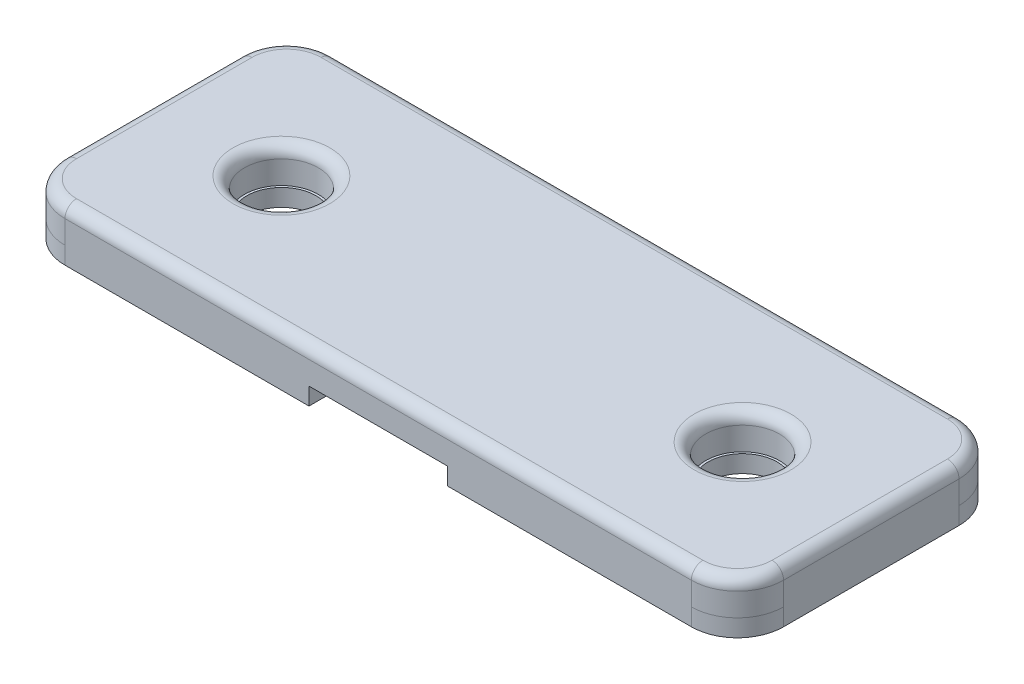
ISO-10303-21;
HEADER;
FILE_DESCRIPTION(('STEP AP214'),'2;1');
FILE_NAME('part.step','',(''),(''),'','','');
FILE_SCHEMA(('AUTOMOTIVE_DESIGN { 1 0 10303 214 1 1 1 1 }'));
ENDSEC;
DATA;
#1=APPLICATION_CONTEXT('core data for automotive mechanical design processes');
#2=APPLICATION_PROTOCOL_DEFINITION('international standard','automotive_design',2000,#1);
#3=PRODUCT_CONTEXT('',#1,'mechanical');
#4=PRODUCT('Part','Part','',(#3));
#5=PRODUCT_RELATED_PRODUCT_CATEGORY('part','',(#4));
#6=PRODUCT_DEFINITION_FORMATION('','',#4);
#7=PRODUCT_DEFINITION_CONTEXT('part definition',#1,'design');
#8=PRODUCT_DEFINITION('design','',#6,#7);
#9=PRODUCT_DEFINITION_SHAPE('','',#8);
#10=(LENGTH_UNIT() NAMED_UNIT(*) SI_UNIT(.MILLI.,.METRE.));
#11=(NAMED_UNIT(*) PLANE_ANGLE_UNIT() SI_UNIT($,.RADIAN.));
#12=(NAMED_UNIT(*) SI_UNIT($,.STERADIAN.) SOLID_ANGLE_UNIT());
#13=UNCERTAINTY_MEASURE_WITH_UNIT(LENGTH_MEASURE(1.E-05),#10,'distance_accuracy_value','');
#14=(GEOMETRIC_REPRESENTATION_CONTEXT(3) GLOBAL_UNCERTAINTY_ASSIGNED_CONTEXT((#13)) GLOBAL_UNIT_ASSIGNED_CONTEXT((#10,
#11,#12)) REPRESENTATION_CONTEXT('',''));
#15=CARTESIAN_POINT('',(0.,0.,0.));
#16=DIRECTION('',(0.,0.,1.));
#17=DIRECTION('',(1.,0.,0.));
#18=AXIS2_PLACEMENT_3D('',#15,#16,#17);
#19=CARTESIAN_POINT('',(0.,0.,0.));
#20=DIRECTION('',(0.,1.,0.));
#21=DIRECTION('',(0.,0.,1.));
#22=AXIS2_PLACEMENT_3D('',#19,#20,#21);
#23=PLANE('',#22);
#24=DIRECTION('',(0.,0.,-1.));
#25=VECTOR('',#24,1.);
#26=CARTESIAN_POINT('',(3.,0.,5.80440630927871));
#27=LINE('',#26,#25);
#28=CARTESIAN_POINT('',(3.,0.,5.80440630927871));
#29=VERTEX_POINT('',#28);
#30=CARTESIAN_POINT('',(3.,0.,-5.80440630927871));
#31=VERTEX_POINT('',#30);
#32=EDGE_CURVE('E196',#29,#31,#27,.T.);
#33=ORIENTED_EDGE('',*,*,#32,.F.);
#34=DIRECTION('',(1.,0.,0.));
#35=VECTOR('',#34,1.);
#36=CARTESIAN_POINT('',(15.5833614940028,0.,5.80440630927871));
#37=LINE('',#36,#35);
#38=CARTESIAN_POINT('',(-3.,0.,5.80440630927871));
#39=VERTEX_POINT('',#38);
#40=EDGE_CURVE('E236',#39,#29,#37,.T.);
#41=ORIENTED_EDGE('',*,*,#40,.F.);
#42=DIRECTION('',(0.,0.,1.));
#43=VECTOR('',#42,1.);
#44=CARTESIAN_POINT('',(-3.,0.,5.80440630927871));
#45=LINE('',#44,#43);
#46=CARTESIAN_POINT('',(-3.,0.,-5.80440630927871));
#47=VERTEX_POINT('',#46);
#48=EDGE_CURVE('E209',#47,#39,#45,.T.);
#49=ORIENTED_EDGE('',*,*,#48,.F.);
#50=DIRECTION('',(-1.,0.,0.));
#51=VECTOR('',#50,1.);
#52=CARTESIAN_POINT('',(15.5833614940028,0.,-5.80440630927871));
#53=LINE('',#52,#51);
#54=EDGE_CURVE('E239',#31,#47,#53,.T.);
#55=ORIENTED_EDGE('',*,*,#54,.F.);
#56=EDGE_LOOP('',(#33,#41,#49,#55));
#57=FACE_BOUND('',#56,.T.);
#58=ADVANCED_FACE('F33',(#57),#23,.F.);
#59=CARTESIAN_POINT('',(0.,1.5,0.));
#60=DIRECTION('',(0.,1.,0.));
#61=DIRECTION('',(0.,0.,1.));
#62=AXIS2_PLACEMENT_3D('',#59,#60,#61);
#63=PLANE('',#62);
#64=CARTESIAN_POINT('',(10.,1.5,0.));
#65=DIRECTION('',(0.,1.,0.));
#66=DIRECTION('',(0.,0.,1.));
#67=AXIS2_PLACEMENT_3D('',#64,#65,#66);
#68=CIRCLE('',#67,2.1);
#69=CARTESIAN_POINT('',(10.,1.5,2.1));
#70=VERTEX_POINT('',#69);
#71=EDGE_CURVE('E317',#70,#70,#68,.F.);
#72=ORIENTED_EDGE('',*,*,#71,.T.);
#73=EDGE_LOOP('',(#72));
#74=FACE_BOUND('',#73,.T.);
#75=DIRECTION('',(0.,0.,-1.));
#76=VECTOR('',#75,1.);
#77=CARTESIAN_POINT('',(15.0833614940028,1.5,-3.80440630927871));
#78=LINE('',#77,#76);
#79=CARTESIAN_POINT('',(15.0833614940028,1.5,3.80440630927871));
#80=VERTEX_POINT('',#79);
#81=CARTESIAN_POINT('',(15.0833614940028,1.5,-3.80440630927871));
#82=VERTEX_POINT('',#81);
#83=EDGE_CURVE('E312',#80,#82,#78,.T.);
#84=ORIENTED_EDGE('',*,*,#83,.T.);
#85=CARTESIAN_POINT('',(13.5833614940028,1.5,-3.80440630927871));
#86=DIRECTION('',(0.,1.,0.));
#87=DIRECTION('',(0.,0.,1.));
#88=AXIS2_PLACEMENT_3D('',#85,#86,#87);
#89=CIRCLE('',#88,1.5);
#90=CARTESIAN_POINT('',(13.5833614940028,1.5,-5.30440630927871));
#91=VERTEX_POINT('',#90);
#92=EDGE_CURVE('E314',#82,#91,#89,.T.);
#93=ORIENTED_EDGE('',*,*,#92,.T.);
#94=DIRECTION('',(-1.,0.,0.));
#95=VECTOR('',#94,1.);
#96=CARTESIAN_POINT('',(-13.5833614940028,1.5,-5.30440630927871));
#97=LINE('',#96,#95);
#98=CARTESIAN_POINT('',(-13.5833614940028,1.5,-5.30440630927871));
#99=VERTEX_POINT('',#98);
#100=EDGE_CURVE('E300',#91,#99,#97,.T.);
#101=ORIENTED_EDGE('',*,*,#100,.T.);
#102=CARTESIAN_POINT('',(-13.5833614940028,1.5,-3.80440630927871));
#103=DIRECTION('',(0.,1.,0.));
#104=DIRECTION('',(0.,0.,1.));
#105=AXIS2_PLACEMENT_3D('',#102,#103,#104);
#106=CIRCLE('',#105,1.5);
#107=CARTESIAN_POINT('',(-15.0833614940028,1.5,-3.80440630927871));
#108=VERTEX_POINT('',#107);
#109=EDGE_CURVE('E302',#99,#108,#106,.T.);
#110=ORIENTED_EDGE('',*,*,#109,.T.);
#111=DIRECTION('',(0.,0.,1.));
#112=VECTOR('',#111,1.);
#113=CARTESIAN_POINT('',(-15.0833614940028,1.5,3.80440630927871));
#114=LINE('',#113,#112);
#115=CARTESIAN_POINT('',(-15.0833614940028,1.5,3.80440630927871));
#116=VERTEX_POINT('',#115);
#117=EDGE_CURVE('E304',#108,#116,#114,.T.);
#118=ORIENTED_EDGE('',*,*,#117,.T.);
#119=CARTESIAN_POINT('',(-13.5833614940028,1.5,3.80440630927871));
#120=DIRECTION('',(0.,1.,0.));
#121=DIRECTION('',(0.,0.,1.));
#122=AXIS2_PLACEMENT_3D('',#119,#120,#121);
#123=CIRCLE('',#122,1.5);
#124=CARTESIAN_POINT('',(-13.5833614940028,1.5,5.30440630927871));
#125=VERTEX_POINT('',#124);
#126=EDGE_CURVE('E306',#116,#125,#123,.T.);
#127=ORIENTED_EDGE('',*,*,#126,.T.);
#128=DIRECTION('',(1.,0.,0.));
#129=VECTOR('',#128,1.);
#130=CARTESIAN_POINT('',(13.5833614940028,1.5,5.30440630927871));
#131=LINE('',#130,#129);
#132=CARTESIAN_POINT('',(13.5833614940028,1.5,5.30440630927871));
#133=VERTEX_POINT('',#132);
#134=EDGE_CURVE('E308',#125,#133,#131,.T.);
#135=ORIENTED_EDGE('',*,*,#134,.T.);
#136=CARTESIAN_POINT('',(13.5833614940028,1.5,3.80440630927871));
#137=DIRECTION('',(0.,1.,0.));
#138=DIRECTION('',(0.,0.,1.));
#139=AXIS2_PLACEMENT_3D('',#136,#137,#138);
#140=CIRCLE('',#139,1.5);
#141=EDGE_CURVE('E310',#133,#80,#140,.T.);
#142=ORIENTED_EDGE('',*,*,#141,.T.);
#143=EDGE_LOOP('',(#84,#93,#101,#110,#118,#127,#135,#142));
#144=FACE_BOUND('',#143,.T.);
#145=CARTESIAN_POINT('',(-10.,1.5,0.));
#146=DIRECTION('',(0.,1.,0.));
#147=DIRECTION('',(0.,0.,1.));
#148=AXIS2_PLACEMENT_3D('',#145,#146,#147);
#149=CIRCLE('',#148,2.1);
#150=CARTESIAN_POINT('',(-10.,1.5,2.1));
#151=VERTEX_POINT('',#150);
#152=EDGE_CURVE('E297',#151,#151,#149,.F.);
#153=ORIENTED_EDGE('',*,*,#152,.T.);
#154=EDGE_LOOP('',(#153));
#155=FACE_BOUND('',#154,.T.);
#156=ADVANCED_FACE('F397',(#74,#144,#155),#63,.T.);
#157=CARTESIAN_POINT('',(-15.5833614940028,1.5,5.80440630927871));
#158=DIRECTION('',(1.,0.,0.));
#159=DIRECTION('',(0.,0.,-1.));
#160=AXIS2_PLACEMENT_3D('',#157,#158,#159);
#161=PLANE('',#160);
#162=DIRECTION('',(0.,-1.,0.));
#163=VECTOR('',#162,1.);
#164=CARTESIAN_POINT('',(-15.5833614940028,1.5,3.80440630927871));
#165=LINE('',#164,#163);
#166=CARTESIAN_POINT('',(-15.5833614940028,0.,3.80440630927871));
#167=VERTEX_POINT('',#166);
#168=CARTESIAN_POINT('',(-15.5833614940028,1.,3.80440630927871));
#169=VERTEX_POINT('',#168);
#170=EDGE_CURVE('E241',#167,#169,#165,.F.);
#171=ORIENTED_EDGE('',*,*,#170,.T.);
#172=DIRECTION('',(0.,0.,1.));
#173=VECTOR('',#172,1.);
#174=CARTESIAN_POINT('',(-15.5833614940028,1.,-3.80440630927871));
#175=LINE('',#174,#173);
#176=CARTESIAN_POINT('',(-15.5833614940028,1.,-3.80440630927871));
#177=VERTEX_POINT('',#176);
#178=EDGE_CURVE('E58',#169,#177,#175,.F.);
#179=ORIENTED_EDGE('',*,*,#178,.T.);
#180=DIRECTION('',(0.,-1.,0.));
#181=VECTOR('',#180,1.);
#182=CARTESIAN_POINT('',(-15.5833614940028,1.5,-3.80440630927871));
#183=LINE('',#182,#181);
#184=CARTESIAN_POINT('',(-15.5833614940028,0.,-3.80440630927871));
#185=VERTEX_POINT('',#184);
#186=EDGE_CURVE('E243',#177,#185,#183,.T.);
#187=ORIENTED_EDGE('',*,*,#186,.T.);
#188=DIRECTION('',(0.,1.,0.));
#189=VECTOR('',#188,1.);
#190=CARTESIAN_POINT('',(-15.5833614940028,1.5,-3.80440630927871));
#191=LINE('',#190,#189);
#192=CARTESIAN_POINT('',(-15.5833614940028,-0.75,-3.80440630927871));
#193=VERTEX_POINT('',#192);
#194=EDGE_CURVE('E267',#185,#193,#191,.F.);
#195=ORIENTED_EDGE('',*,*,#194,.T.);
#196=DIRECTION('',(0.,0.,-1.));
#197=VECTOR('',#196,1.);
#198=CARTESIAN_POINT('',(-15.5833614940028,-0.75,5.80440630927871));
#199=LINE('',#198,#197);
#200=CARTESIAN_POINT('',(-15.5833614940028,-0.75,3.80440630927871));
#201=VERTEX_POINT('',#200);
#202=EDGE_CURVE('E217',#201,#193,#199,.T.);
#203=ORIENTED_EDGE('',*,*,#202,.F.);
#204=DIRECTION('',(0.,1.,0.));
#205=VECTOR('',#204,1.);
#206=CARTESIAN_POINT('',(-15.5833614940028,1.5,3.80440630927871));
#207=LINE('',#206,#205);
#208=EDGE_CURVE('E269',#201,#167,#207,.T.);
#209=ORIENTED_EDGE('',*,*,#208,.T.);
#210=EDGE_LOOP('',(#171,#179,#187,#195,#203,#209));
#211=FACE_BOUND('',#210,.T.);
#212=ADVANCED_FACE('F444',(#211),#161,.F.);
#213=CARTESIAN_POINT('',(15.5833614940028,1.5,5.80440630927871));
#214=DIRECTION('',(0.,0.,-1.));
#215=DIRECTION('',(-1.,0.,0.));
#216=AXIS2_PLACEMENT_3D('',#213,#214,#215);
#217=PLANE('',#216);
#218=DIRECTION('',(0.,-1.,0.));
#219=VECTOR('',#218,1.);
#220=CARTESIAN_POINT('',(13.5833614940028,1.5,5.80440630927871));
#221=LINE('',#220,#219);
#222=CARTESIAN_POINT('',(13.5833614940028,0.,5.80440630927871));
#223=VERTEX_POINT('',#222);
#224=CARTESIAN_POINT('',(13.5833614940028,1.,5.80440630927871));
#225=VERTEX_POINT('',#224);
#226=EDGE_CURVE('E264',#223,#225,#221,.F.);
#227=ORIENTED_EDGE('',*,*,#226,.T.);
#228=DIRECTION('',(1.,0.,0.));
#229=VECTOR('',#228,1.);
#230=CARTESIAN_POINT('',(-13.5833614940028,1.,5.80440630927871));
#231=LINE('',#230,#229);
#232=CARTESIAN_POINT('',(-13.5833614940028,1.,5.80440630927871));
#233=VERTEX_POINT('',#232);
#234=EDGE_CURVE('E327',#225,#233,#231,.F.);
#235=ORIENTED_EDGE('',*,*,#234,.T.);
#236=DIRECTION('',(0.,-1.,0.));
#237=VECTOR('',#236,1.);
#238=CARTESIAN_POINT('',(-13.5833614940028,1.5,5.80440630927871));
#239=LINE('',#238,#237);
#240=CARTESIAN_POINT('',(-13.5833614940028,0.,5.80440630927871));
#241=VERTEX_POINT('',#240);
#242=EDGE_CURVE('E262',#233,#241,#239,.T.);
#243=ORIENTED_EDGE('',*,*,#242,.T.);
#244=DIRECTION('',(0.,1.,0.));
#245=VECTOR('',#244,1.);
#246=CARTESIAN_POINT('',(-13.5833614940028,1.5,5.80440630927871));
#247=LINE('',#246,#245);
#248=CARTESIAN_POINT('',(-13.5833614940028,-0.75,5.80440630927871));
#249=VERTEX_POINT('',#248);
#250=EDGE_CURVE('E275',#241,#249,#247,.F.);
#251=ORIENTED_EDGE('',*,*,#250,.T.);
#252=DIRECTION('',(-1.,0.,0.));
#253=VECTOR('',#252,1.);
#254=CARTESIAN_POINT('',(-3.,-0.75,5.80440630927871));
#255=LINE('',#254,#253);
#256=CARTESIAN_POINT('',(-3.,-0.75,5.80440630927871));
#257=VERTEX_POINT('',#256);
#258=EDGE_CURVE('E214',#257,#249,#255,.T.);
#259=ORIENTED_EDGE('',*,*,#258,.F.);
#260=DIRECTION('',(0.,1.,0.));
#261=VECTOR('',#260,1.);
#262=CARTESIAN_POINT('',(-3.,-0.75,5.80440630927871));
#263=LINE('',#262,#261);
#264=EDGE_CURVE('E227',#257,#39,#263,.T.);
#265=ORIENTED_EDGE('',*,*,#264,.T.);
#266=ORIENTED_EDGE('',*,*,#40,.T.);
#267=DIRECTION('',(0.,1.,0.));
#268=VECTOR('',#267,1.);
#269=CARTESIAN_POINT('',(3.,-0.75,5.80440630927871));
#270=LINE('',#269,#268);
#271=CARTESIAN_POINT('',(3.,-0.75,5.80440630927871));
#272=VERTEX_POINT('',#271);
#273=EDGE_CURVE('E200',#272,#29,#270,.T.);
#274=ORIENTED_EDGE('',*,*,#273,.F.);
#275=DIRECTION('',(-1.,0.,0.));
#276=VECTOR('',#275,1.);
#277=CARTESIAN_POINT('',(3.,-0.75,5.80440630927871));
#278=LINE('',#277,#276);
#279=CARTESIAN_POINT('',(13.5833614940028,-0.75,5.80440630927871));
#280=VERTEX_POINT('',#279);
#281=EDGE_CURVE('E192',#280,#272,#278,.T.);
#282=ORIENTED_EDGE('',*,*,#281,.F.);
#283=DIRECTION('',(0.,1.,0.));
#284=VECTOR('',#283,1.);
#285=CARTESIAN_POINT('',(13.5833614940028,1.5,5.80440630927871));
#286=LINE('',#285,#284);
#287=EDGE_CURVE('E272',#280,#223,#286,.T.);
#288=ORIENTED_EDGE('',*,*,#287,.T.);
#289=EDGE_LOOP('',(#227,#235,#243,#251,#259,#265,#266,#274,#282,#288));
#290=FACE_BOUND('',#289,.T.);
#291=ADVANCED_FACE('F380',(#290),#217,.F.);
#292=CARTESIAN_POINT('',(15.5833614940028,1.5,5.80440630927871));
#293=DIRECTION('',(-1.,0.,0.));
#294=DIRECTION('',(0.,0.,1.));
#295=AXIS2_PLACEMENT_3D('',#292,#293,#294);
#296=PLANE('',#295);
#297=DIRECTION('',(0.,-1.,0.));
#298=VECTOR('',#297,1.);
#299=CARTESIAN_POINT('',(15.5833614940028,1.5,-3.80440630927871));
#300=LINE('',#299,#298);
#301=CARTESIAN_POINT('',(15.5833614940028,0.,-3.80440630927871));
#302=VERTEX_POINT('',#301);
#303=CARTESIAN_POINT('',(15.5833614940028,1.,-3.80440630927871));
#304=VERTEX_POINT('',#303);
#305=EDGE_CURVE('E259',#302,#304,#300,.F.);
#306=ORIENTED_EDGE('',*,*,#305,.T.);
#307=DIRECTION('',(0.,0.,-1.));
#308=VECTOR('',#307,1.);
#309=CARTESIAN_POINT('',(15.5833614940028,1.,3.80440630927871));
#310=LINE('',#309,#308);
#311=CARTESIAN_POINT('',(15.5833614940028,1.,3.80440630927871));
#312=VERTEX_POINT('',#311);
#313=EDGE_CURVE('E323',#304,#312,#310,.F.);
#314=ORIENTED_EDGE('',*,*,#313,.T.);
#315=DIRECTION('',(0.,-1.,0.));
#316=VECTOR('',#315,1.);
#317=CARTESIAN_POINT('',(15.5833614940028,1.5,3.80440630927871));
#318=LINE('',#317,#316);
#319=CARTESIAN_POINT('',(15.5833614940028,0.,3.80440630927871));
#320=VERTEX_POINT('',#319);
#321=EDGE_CURVE('E257',#312,#320,#318,.T.);
#322=ORIENTED_EDGE('',*,*,#321,.T.);
#323=DIRECTION('',(0.,1.,0.));
#324=VECTOR('',#323,1.);
#325=CARTESIAN_POINT('',(15.5833614940028,1.5,3.80440630927871));
#326=LINE('',#325,#324);
#327=CARTESIAN_POINT('',(15.5833614940028,-0.75,3.80440630927871));
#328=VERTEX_POINT('',#327);
#329=EDGE_CURVE('E288',#320,#328,#326,.F.);
#330=ORIENTED_EDGE('',*,*,#329,.T.);
#331=DIRECTION('',(0.,0.,1.));
#332=VECTOR('',#331,1.);
#333=CARTESIAN_POINT('',(15.5833614940028,-0.75,5.80440630927871));
#334=LINE('',#333,#332);
#335=CARTESIAN_POINT('',(15.5833614940028,-0.75,-3.80440630927871));
#336=VERTEX_POINT('',#335);
#337=EDGE_CURVE('E184',#336,#328,#334,.T.);
#338=ORIENTED_EDGE('',*,*,#337,.F.);
#339=DIRECTION('',(0.,1.,0.));
#340=VECTOR('',#339,1.);
#341=CARTESIAN_POINT('',(15.5833614940028,1.5,-3.80440630927871));
#342=LINE('',#341,#340);
#343=EDGE_CURVE('E285',#336,#302,#342,.T.);
#344=ORIENTED_EDGE('',*,*,#343,.T.);
#345=EDGE_LOOP('',(#306,#314,#322,#330,#338,#344));
#346=FACE_BOUND('',#345,.T.);
#347=ADVANCED_FACE('F452',(#346),#296,.F.);
#348=CARTESIAN_POINT('',(15.5833614940028,1.5,-5.80440630927871));
#349=DIRECTION('',(0.,0.,1.));
#350=DIRECTION('',(1.,0.,0.));
#351=AXIS2_PLACEMENT_3D('',#348,#349,#350);
#352=PLANE('',#351);
#353=DIRECTION('',(0.,-1.,0.));
#354=VECTOR('',#353,1.);
#355=CARTESIAN_POINT('',(-13.5833614940028,1.5,-5.80440630927871));
#356=LINE('',#355,#354);
#357=CARTESIAN_POINT('',(-13.5833614940028,0.,-5.80440630927871));
#358=VERTEX_POINT('',#357);
#359=CARTESIAN_POINT('',(-13.5833614940028,1.,-5.80440630927871));
#360=VERTEX_POINT('',#359);
#361=EDGE_CURVE('E255',#358,#360,#356,.F.);
#362=ORIENTED_EDGE('',*,*,#361,.T.);
#363=DIRECTION('',(-1.,0.,0.));
#364=VECTOR('',#363,1.);
#365=CARTESIAN_POINT('',(13.5833614940028,1.,-5.80440630927871));
#366=LINE('',#365,#364);
#367=CARTESIAN_POINT('',(13.5833614940028,1.,-5.80440630927871));
#368=VERTEX_POINT('',#367);
#369=EDGE_CURVE('E42',#360,#368,#366,.F.);
#370=ORIENTED_EDGE('',*,*,#369,.T.);
#371=DIRECTION('',(0.,-1.,0.));
#372=VECTOR('',#371,1.);
#373=CARTESIAN_POINT('',(13.5833614940028,1.5,-5.80440630927871));
#374=LINE('',#373,#372);
#375=CARTESIAN_POINT('',(13.5833614940028,0.,-5.80440630927871));
#376=VERTEX_POINT('',#375);
#377=EDGE_CURVE('E253',#368,#376,#374,.T.);
#378=ORIENTED_EDGE('',*,*,#377,.T.);
#379=DIRECTION('',(0.,1.,0.));
#380=VECTOR('',#379,1.);
#381=CARTESIAN_POINT('',(13.5833614940028,1.5,-5.80440630927871));
#382=LINE('',#381,#380);
#383=CARTESIAN_POINT('',(13.5833614940028,-0.75,-5.80440630927871));
#384=VERTEX_POINT('',#383);
#385=EDGE_CURVE('E181',#376,#384,#382,.F.);
#386=ORIENTED_EDGE('',*,*,#385,.T.);
#387=DIRECTION('',(1.,0.,0.));
#388=VECTOR('',#387,1.);
#389=CARTESIAN_POINT('',(3.,-0.75,-5.80440630927871));
#390=LINE('',#389,#388);
#391=CARTESIAN_POINT('',(3.,-0.75,-5.80440630927871));
#392=VERTEX_POINT('',#391);
#393=EDGE_CURVE('E174',#392,#384,#390,.T.);
#394=ORIENTED_EDGE('',*,*,#393,.F.);
#395=DIRECTION('',(0.,1.,0.));
#396=VECTOR('',#395,1.);
#397=CARTESIAN_POINT('',(3.,-0.75,-5.80440630927871));
#398=LINE('',#397,#396);
#399=EDGE_CURVE('E178',#392,#31,#398,.T.);
#400=ORIENTED_EDGE('',*,*,#399,.T.);
#401=ORIENTED_EDGE('',*,*,#54,.T.);
#402=DIRECTION('',(0.,1.,0.));
#403=VECTOR('',#402,1.);
#404=CARTESIAN_POINT('',(-3.,-0.75,-5.80440630927871));
#405=LINE('',#404,#403);
#406=CARTESIAN_POINT('',(-3.,-0.75,-5.80440630927871));
#407=VERTEX_POINT('',#406);
#408=EDGE_CURVE('E222',#407,#47,#405,.T.);
#409=ORIENTED_EDGE('',*,*,#408,.F.);
#410=DIRECTION('',(1.,0.,0.));
#411=VECTOR('',#410,1.);
#412=CARTESIAN_POINT('',(-3.,-0.75,-5.80440630927871));
#413=LINE('',#412,#411);
#414=CARTESIAN_POINT('',(-13.5833614940028,-0.75,-5.80440630927871));
#415=VERTEX_POINT('',#414);
#416=EDGE_CURVE('E220',#415,#407,#413,.T.);
#417=ORIENTED_EDGE('',*,*,#416,.F.);
#418=DIRECTION('',(0.,1.,0.));
#419=VECTOR('',#418,1.);
#420=CARTESIAN_POINT('',(-13.5833614940028,1.5,-5.80440630927871));
#421=LINE('',#420,#419);
#422=EDGE_CURVE('E282',#415,#358,#421,.T.);
#423=ORIENTED_EDGE('',*,*,#422,.T.);
#424=EDGE_LOOP('',(#362,#370,#378,#386,#394,#400,#401,#409,#417,#423));
#425=FACE_BOUND('',#424,.T.);
#426=ADVANCED_FACE('F176',(#425),#352,.F.);
#427=CARTESIAN_POINT('',(-10.,1.5,0.));
#428=DIRECTION('',(0.,-1.,0.));
#429=DIRECTION('',(0.,0.,-1.));
#430=AXIS2_PLACEMENT_3D('',#427,#428,#429);
#431=CYLINDRICAL_SURFACE('',#430,1.6);
#432=CARTESIAN_POINT('',(-10.,1.,0.));
#433=DIRECTION('',(0.,1.,0.));
#434=DIRECTION('',(0.,0.,1.));
#435=AXIS2_PLACEMENT_3D('',#432,#433,#434);
#436=CIRCLE('',#435,1.6);
#437=CARTESIAN_POINT('',(-10.,1.,1.6));
#438=VERTEX_POINT('',#437);
#439=EDGE_CURVE('E11',#438,#438,#436,.T.);
#440=ORIENTED_EDGE('',*,*,#439,.T.);
#441=EDGE_LOOP('',(#440));
#442=FACE_BOUND('',#441,.T.);
#443=CARTESIAN_POINT('',(-10.,0.,0.));
#444=DIRECTION('',(0.,1.,0.));
#445=DIRECTION('',(0.,0.,1.));
#446=AXIS2_PLACEMENT_3D('',#443,#444,#445);
#447=CIRCLE('',#446,1.6);
#448=CARTESIAN_POINT('',(-10.,0.,1.6));
#449=VERTEX_POINT('',#448);
#450=EDGE_CURVE('E233',#449,#449,#447,.T.);
#451=ORIENTED_EDGE('',*,*,#450,.F.);
#452=EDGE_LOOP('',(#451));
#453=FACE_BOUND('',#452,.T.);
#454=ADVANCED_FACE('F451',(#442,#453),#431,.F.);
#455=CARTESIAN_POINT('',(10.,1.5,0.));
#456=DIRECTION('',(0.,-1.,0.));
#457=DIRECTION('',(0.,0.,-1.));
#458=AXIS2_PLACEMENT_3D('',#455,#456,#457);
#459=CYLINDRICAL_SURFACE('',#458,1.6);
#460=CARTESIAN_POINT('',(10.,1.,0.));
#461=DIRECTION('',(0.,1.,0.));
#462=DIRECTION('',(0.,0.,1.));
#463=AXIS2_PLACEMENT_3D('',#460,#461,#462);
#464=CIRCLE('',#463,1.6);
#465=CARTESIAN_POINT('',(10.,1.,1.6));
#466=VERTEX_POINT('',#465);
#467=EDGE_CURVE('E294',#466,#466,#464,.T.);
#468=ORIENTED_EDGE('',*,*,#467,.T.);
#469=EDGE_LOOP('',(#468));
#470=FACE_BOUND('',#469,.T.);
#471=CARTESIAN_POINT('',(10.,0.,0.));
#472=DIRECTION('',(0.,1.,0.));
#473=DIRECTION('',(0.,0.,1.));
#474=AXIS2_PLACEMENT_3D('',#471,#472,#473);
#475=CIRCLE('',#474,1.6);
#476=CARTESIAN_POINT('',(10.,0.,1.6));
#477=VERTEX_POINT('',#476);
#478=EDGE_CURVE('E230',#477,#477,#475,.T.);
#479=ORIENTED_EDGE('',*,*,#478,.F.);
#480=EDGE_LOOP('',(#479));
#481=FACE_BOUND('',#480,.T.);
#482=ADVANCED_FACE('F462',(#470,#481),#459,.F.);
#483=CARTESIAN_POINT('',(-13.5833614940028,1.5,-3.80440630927871));
#484=DIRECTION('',(0.,-1.,0.));
#485=DIRECTION('',(0.,0.,-1.));
#486=AXIS2_PLACEMENT_3D('',#483,#484,#485);
#487=CYLINDRICAL_SURFACE('',#486,2.);
#488=ORIENTED_EDGE('',*,*,#186,.F.);
#489=CARTESIAN_POINT('',(-13.5833614940028,1.,-3.80440630927871));
#490=DIRECTION('',(0.,1.,0.));
#491=DIRECTION('',(0.,0.,1.));
#492=AXIS2_PLACEMENT_3D('',#489,#490,#491);
#493=CIRCLE('',#492,2.);
#494=EDGE_CURVE('E50',#177,#360,#493,.F.);
#495=ORIENTED_EDGE('',*,*,#494,.T.);
#496=ORIENTED_EDGE('',*,*,#361,.F.);
#497=CARTESIAN_POINT('',(-13.5833614940028,0.,-3.80440630927871));
#498=DIRECTION('',(0.,1.,0.));
#499=DIRECTION('',(0.,0.,1.));
#500=AXIS2_PLACEMENT_3D('',#497,#498,#499);
#501=CIRCLE('',#500,2.);
#502=EDGE_CURVE('E251',#185,#358,#501,.F.);
#503=ORIENTED_EDGE('',*,*,#502,.F.);
#504=EDGE_LOOP('',(#488,#495,#496,#503));
#505=FACE_BOUND('',#504,.T.);
#506=ADVANCED_FACE('F459',(#505),#487,.T.);
#507=CARTESIAN_POINT('',(13.5833614940028,1.5,-3.80440630927871));
#508=DIRECTION('',(0.,-1.,0.));
#509=DIRECTION('',(0.,0.,-1.));
#510=AXIS2_PLACEMENT_3D('',#507,#508,#509);
#511=CYLINDRICAL_SURFACE('',#510,2.);
#512=ORIENTED_EDGE('',*,*,#377,.F.);
#513=CARTESIAN_POINT('',(13.5833614940028,1.,-3.80440630927871));
#514=DIRECTION('',(0.,1.,0.));
#515=DIRECTION('',(0.,0.,1.));
#516=AXIS2_PLACEMENT_3D('',#513,#514,#515);
#517=CIRCLE('',#516,2.);
#518=EDGE_CURVE('E320',#368,#304,#517,.F.);
#519=ORIENTED_EDGE('',*,*,#518,.T.);
#520=ORIENTED_EDGE('',*,*,#305,.F.);
#521=CARTESIAN_POINT('',(13.5833614940028,0.,-3.80440630927871));
#522=DIRECTION('',(0.,1.,0.));
#523=DIRECTION('',(0.,0.,1.));
#524=AXIS2_PLACEMENT_3D('',#521,#522,#523);
#525=CIRCLE('',#524,2.);
#526=EDGE_CURVE('E249',#376,#302,#525,.F.);
#527=ORIENTED_EDGE('',*,*,#526,.F.);
#528=EDGE_LOOP('',(#512,#519,#520,#527));
#529=FACE_BOUND('',#528,.T.);
#530=ADVANCED_FACE('F425',(#529),#511,.T.);
#531=CARTESIAN_POINT('',(13.5833614940028,1.5,3.80440630927871));
#532=DIRECTION('',(0.,-1.,0.));
#533=DIRECTION('',(0.,0.,-1.));
#534=AXIS2_PLACEMENT_3D('',#531,#532,#533);
#535=CYLINDRICAL_SURFACE('',#534,2.);
#536=ORIENTED_EDGE('',*,*,#321,.F.);
#537=CARTESIAN_POINT('',(13.5833614940028,1.,3.80440630927871));
#538=DIRECTION('',(0.,1.,0.));
#539=DIRECTION('',(0.,0.,1.));
#540=AXIS2_PLACEMENT_3D('',#537,#538,#539);
#541=CIRCLE('',#540,2.);
#542=EDGE_CURVE('E325',#312,#225,#541,.F.);
#543=ORIENTED_EDGE('',*,*,#542,.T.);
#544=ORIENTED_EDGE('',*,*,#226,.F.);
#545=CARTESIAN_POINT('',(13.5833614940028,0.,3.80440630927871));
#546=DIRECTION('',(0.,1.,0.));
#547=DIRECTION('',(0.,0.,1.));
#548=AXIS2_PLACEMENT_3D('',#545,#546,#547);
#549=CIRCLE('',#548,2.);
#550=EDGE_CURVE('E247',#320,#223,#549,.F.);
#551=ORIENTED_EDGE('',*,*,#550,.F.);
#552=EDGE_LOOP('',(#536,#543,#544,#551));
#553=FACE_BOUND('',#552,.T.);
#554=ADVANCED_FACE('F383',(#553),#535,.T.);
#555=CARTESIAN_POINT('',(-13.5833614940028,1.5,3.80440630927871));
#556=DIRECTION('',(0.,-1.,0.));
#557=DIRECTION('',(0.,0.,-1.));
#558=AXIS2_PLACEMENT_3D('',#555,#556,#557);
#559=CYLINDRICAL_SURFACE('',#558,2.);
#560=ORIENTED_EDGE('',*,*,#242,.F.);
#561=CARTESIAN_POINT('',(-13.5833614940028,1.,3.80440630927871));
#562=DIRECTION('',(0.,1.,0.));
#563=DIRECTION('',(0.,0.,1.));
#564=AXIS2_PLACEMENT_3D('',#561,#562,#563);
#565=CIRCLE('',#564,2.);
#566=EDGE_CURVE('E329',#233,#169,#565,.F.);
#567=ORIENTED_EDGE('',*,*,#566,.T.);
#568=ORIENTED_EDGE('',*,*,#170,.F.);
#569=CARTESIAN_POINT('',(-13.5833614940028,0.,3.80440630927871));
#570=DIRECTION('',(0.,1.,0.));
#571=DIRECTION('',(0.,0.,1.));
#572=AXIS2_PLACEMENT_3D('',#569,#570,#571);
#573=CIRCLE('',#572,2.);
#574=EDGE_CURVE('E245',#241,#167,#573,.F.);
#575=ORIENTED_EDGE('',*,*,#574,.F.);
#576=EDGE_LOOP('',(#560,#567,#568,#575));
#577=FACE_BOUND('',#576,.T.);
#578=ADVANCED_FACE('F405',(#577),#559,.T.);
#579=CARTESIAN_POINT('',(0.,-0.75,0.));
#580=DIRECTION('',(0.,1.,0.));
#581=DIRECTION('',(0.,0.,1.));
#582=AXIS2_PLACEMENT_3D('',#579,#580,#581);
#583=PLANE('',#582);
#584=ORIENTED_EDGE('',*,*,#258,.T.);
#585=CARTESIAN_POINT('',(-13.5833614940028,-0.75,3.80440630927871));
#586=DIRECTION('',(0.,1.,0.));
#587=DIRECTION('',(0.,0.,1.));
#588=AXIS2_PLACEMENT_3D('',#585,#586,#587);
#589=CIRCLE('',#588,2.);
#590=EDGE_CURVE('E279',#249,#201,#589,.F.);
#591=ORIENTED_EDGE('',*,*,#590,.T.);
#592=ORIENTED_EDGE('',*,*,#202,.T.);
#593=CARTESIAN_POINT('',(-13.5833614940028,-0.75,-3.80440630927871));
#594=DIRECTION('',(0.,1.,0.));
#595=DIRECTION('',(0.,0.,1.));
#596=AXIS2_PLACEMENT_3D('',#593,#594,#595);
#597=CIRCLE('',#596,2.);
#598=EDGE_CURVE('E277',#193,#415,#597,.F.);
#599=ORIENTED_EDGE('',*,*,#598,.T.);
#600=ORIENTED_EDGE('',*,*,#416,.T.);
#601=DIRECTION('',(0.,0.,1.));
#602=VECTOR('',#601,1.);
#603=CARTESIAN_POINT('',(-3.,-0.75,5.80440630927871));
#604=LINE('',#603,#602);
#605=EDGE_CURVE('E211',#407,#257,#604,.T.);
#606=ORIENTED_EDGE('',*,*,#605,.T.);
#607=EDGE_LOOP('',(#584,#591,#592,#599,#600,#606));
#608=FACE_BOUND('',#607,.T.);
#609=CARTESIAN_POINT('',(-10.,-0.75,0.));
#610=DIRECTION('',(0.,-1.,0.));
#611=DIRECTION('',(0.,0.,-1.));
#612=AXIS2_PLACEMENT_3D('',#609,#610,#611);
#613=CIRCLE('',#612,1.5);
#614=CARTESIAN_POINT('',(-10.,-0.75,-1.5));
#615=VERTEX_POINT('',#614);
#616=EDGE_CURVE('E203',#615,#615,#613,.T.);
#617=ORIENTED_EDGE('',*,*,#616,.F.);
#618=EDGE_LOOP('',(#617));
#619=FACE_BOUND('',#618,.T.);
#620=ADVANCED_FACE('F469',(#608,#619),#583,.F.);
#621=CARTESIAN_POINT('',(0.,0.,0.));
#622=DIRECTION('',(0.,1.,0.));
#623=DIRECTION('',(0.,0.,1.));
#624=AXIS2_PLACEMENT_3D('',#621,#622,#623);
#625=PLANE('',#624);
#626=ORIENTED_EDGE('',*,*,#450,.T.);
#627=EDGE_LOOP('',(#626));
#628=FACE_BOUND('',#627,.T.);
#629=CARTESIAN_POINT('',(-10.,0.,0.));
#630=DIRECTION('',(0.,-1.,0.));
#631=DIRECTION('',(0.,0.,-1.));
#632=AXIS2_PLACEMENT_3D('',#629,#630,#631);
#633=CIRCLE('',#632,1.5);
#634=CARTESIAN_POINT('',(-10.,0.,-1.5));
#635=VERTEX_POINT('',#634);
#636=EDGE_CURVE('E199',#635,#635,#633,.T.);
#637=ORIENTED_EDGE('',*,*,#636,.T.);
#638=EDGE_LOOP('',(#637));
#639=FACE_BOUND('',#638,.T.);
#640=ADVANCED_FACE('F517',(#628,#639),#625,.T.);
#641=CARTESIAN_POINT('',(-3.,-0.75,5.80440630927871));
#642=DIRECTION('',(-1.,0.,0.));
#643=DIRECTION('',(0.,0.,1.));
#644=AXIS2_PLACEMENT_3D('',#641,#642,#643);
#645=PLANE('',#644);
#646=ORIENTED_EDGE('',*,*,#48,.T.);
#647=ORIENTED_EDGE('',*,*,#264,.F.);
#648=ORIENTED_EDGE('',*,*,#605,.F.);
#649=ORIENTED_EDGE('',*,*,#408,.T.);
#650=EDGE_LOOP('',(#646,#647,#648,#649));
#651=FACE_BOUND('',#650,.T.);
#652=ADVANCED_FACE('F508',(#651),#645,.F.);
#653=CARTESIAN_POINT('',(-10.,-0.75,0.));
#654=DIRECTION('',(0.,1.,0.));
#655=DIRECTION('',(0.,0.,1.));
#656=AXIS2_PLACEMENT_3D('',#653,#654,#655);
#657=CYLINDRICAL_SURFACE('',#656,1.5);
#658=ORIENTED_EDGE('',*,*,#616,.T.);
#659=EDGE_LOOP('',(#658));
#660=FACE_BOUND('',#659,.T.);
#661=ORIENTED_EDGE('',*,*,#636,.F.);
#662=EDGE_LOOP('',(#661));
#663=FACE_BOUND('',#662,.T.);
#664=ADVANCED_FACE('F501',(#660,#663),#657,.F.);
#665=CARTESIAN_POINT('',(0.,0.,0.));
#666=DIRECTION('',(0.,-1.,0.));
#667=DIRECTION('',(0.,0.,-1.));
#668=AXIS2_PLACEMENT_3D('',#665,#666,#667);
#669=PLANE('',#668);
#670=ORIENTED_EDGE('',*,*,#478,.T.);
#671=EDGE_LOOP('',(#670));
#672=FACE_BOUND('',#671,.T.);
#673=CARTESIAN_POINT('',(10.,0.,0.));
#674=DIRECTION('',(0.,-1.,0.));
#675=DIRECTION('',(0.,0.,-1.));
#676=AXIS2_PLACEMENT_3D('',#673,#674,#675);
#677=CIRCLE('',#676,1.5);
#678=CARTESIAN_POINT('',(10.,0.,-1.5));
#679=VERTEX_POINT('',#678);
#680=EDGE_CURVE('E355',#679,#679,#677,.T.);
#681=ORIENTED_EDGE('',*,*,#680,.T.);
#682=EDGE_LOOP('',(#681));
#683=FACE_BOUND('',#682,.T.);
#684=ADVANCED_FACE('F499',(#672,#683),#669,.F.);
#685=CARTESIAN_POINT('',(0.,-0.75,0.));
#686=DIRECTION('',(0.,-1.,0.));
#687=DIRECTION('',(0.,0.,-1.));
#688=AXIS2_PLACEMENT_3D('',#685,#686,#687);
#689=PLANE('',#688);
#690=ORIENTED_EDGE('',*,*,#337,.T.);
#691=CARTESIAN_POINT('',(13.5833614940028,-0.75,3.80440630927871));
#692=DIRECTION('',(0.,-1.,0.));
#693=DIRECTION('',(0.,0.,-1.));
#694=AXIS2_PLACEMENT_3D('',#691,#692,#693);
#695=CIRCLE('',#694,2.);
#696=EDGE_CURVE('E292',#328,#280,#695,.T.);
#697=ORIENTED_EDGE('',*,*,#696,.T.);
#698=ORIENTED_EDGE('',*,*,#281,.T.);
#699=DIRECTION('',(0.,0.,-1.));
#700=VECTOR('',#699,1.);
#701=CARTESIAN_POINT('',(3.,-0.75,5.80440630927871));
#702=LINE('',#701,#700);
#703=EDGE_CURVE('E185',#272,#392,#702,.T.);
#704=ORIENTED_EDGE('',*,*,#703,.T.);
#705=ORIENTED_EDGE('',*,*,#393,.T.);
#706=CARTESIAN_POINT('',(13.5833614940028,-0.75,-3.80440630927871));
#707=DIRECTION('',(0.,-1.,0.));
#708=DIRECTION('',(0.,0.,-1.));
#709=AXIS2_PLACEMENT_3D('',#706,#707,#708);
#710=CIRCLE('',#709,2.);
#711=EDGE_CURVE('E290',#384,#336,#710,.T.);
#712=ORIENTED_EDGE('',*,*,#711,.T.);
#713=EDGE_LOOP('',(#690,#697,#698,#704,#705,#712));
#714=FACE_BOUND('',#713,.T.);
#715=CARTESIAN_POINT('',(10.,-0.75,0.));
#716=DIRECTION('',(0.,-1.,0.));
#717=DIRECTION('',(0.,0.,-1.));
#718=AXIS2_PLACEMENT_3D('',#715,#716,#717);
#719=CIRCLE('',#718,1.5);
#720=CARTESIAN_POINT('',(10.,-0.75,-1.5));
#721=VERTEX_POINT('',#720);
#722=EDGE_CURVE('E361',#721,#721,#719,.T.);
#723=ORIENTED_EDGE('',*,*,#722,.F.);
#724=EDGE_LOOP('',(#723));
#725=FACE_BOUND('',#724,.T.);
#726=ADVANCED_FACE('F189',(#714,#725),#689,.T.);
#727=CARTESIAN_POINT('',(3.,-0.75,5.80440630927871));
#728=DIRECTION('',(1.,0.,0.));
#729=DIRECTION('',(0.,0.,-1.));
#730=AXIS2_PLACEMENT_3D('',#727,#728,#729);
#731=PLANE('',#730);
#732=ORIENTED_EDGE('',*,*,#32,.T.);
#733=ORIENTED_EDGE('',*,*,#399,.F.);
#734=ORIENTED_EDGE('',*,*,#703,.F.);
#735=ORIENTED_EDGE('',*,*,#273,.T.);
#736=EDGE_LOOP('',(#732,#733,#734,#735));
#737=FACE_BOUND('',#736,.T.);
#738=ADVANCED_FACE('F198',(#737),#731,.F.);
#739=CARTESIAN_POINT('',(10.,-0.75,0.));
#740=DIRECTION('',(0.,1.,0.));
#741=DIRECTION('',(0.,0.,1.));
#742=AXIS2_PLACEMENT_3D('',#739,#740,#741);
#743=CYLINDRICAL_SURFACE('',#742,1.5);
#744=ORIENTED_EDGE('',*,*,#722,.T.);
#745=EDGE_LOOP('',(#744));
#746=FACE_BOUND('',#745,.T.);
#747=ORIENTED_EDGE('',*,*,#680,.F.);
#748=EDGE_LOOP('',(#747));
#749=FACE_BOUND('',#748,.T.);
#750=ADVANCED_FACE('F474',(#746,#749),#743,.F.);
#751=CARTESIAN_POINT('',(-13.5833614940028,1.5,3.80440630927871));
#752=DIRECTION('',(0.,1.,0.));
#753=DIRECTION('',(0.,0.,1.));
#754=AXIS2_PLACEMENT_3D('',#751,#752,#753);
#755=CYLINDRICAL_SURFACE('',#754,2.);
#756=ORIENTED_EDGE('',*,*,#590,.F.);
#757=ORIENTED_EDGE('',*,*,#250,.F.);
#758=ORIENTED_EDGE('',*,*,#574,.T.);
#759=ORIENTED_EDGE('',*,*,#208,.F.);
#760=EDGE_LOOP('',(#756,#757,#758,#759));
#761=FACE_BOUND('',#760,.T.);
#762=ADVANCED_FACE('F470',(#761),#755,.T.);
#763=CARTESIAN_POINT('',(-13.5833614940028,1.5,-3.80440630927871));
#764=DIRECTION('',(0.,1.,0.));
#765=DIRECTION('',(0.,0.,1.));
#766=AXIS2_PLACEMENT_3D('',#763,#764,#765);
#767=CYLINDRICAL_SURFACE('',#766,2.);
#768=ORIENTED_EDGE('',*,*,#598,.F.);
#769=ORIENTED_EDGE('',*,*,#194,.F.);
#770=ORIENTED_EDGE('',*,*,#502,.T.);
#771=ORIENTED_EDGE('',*,*,#422,.F.);
#772=EDGE_LOOP('',(#768,#769,#770,#771));
#773=FACE_BOUND('',#772,.T.);
#774=ADVANCED_FACE('F473',(#773),#767,.T.);
#775=CARTESIAN_POINT('',(13.5833614940028,1.5,3.80440630927871));
#776=DIRECTION('',(0.,1.,0.));
#777=DIRECTION('',(0.,0.,1.));
#778=AXIS2_PLACEMENT_3D('',#775,#776,#777);
#779=CYLINDRICAL_SURFACE('',#778,2.);
#780=ORIENTED_EDGE('',*,*,#696,.F.);
#781=ORIENTED_EDGE('',*,*,#329,.F.);
#782=ORIENTED_EDGE('',*,*,#550,.T.);
#783=ORIENTED_EDGE('',*,*,#287,.F.);
#784=EDGE_LOOP('',(#780,#781,#782,#783));
#785=FACE_BOUND('',#784,.T.);
#786=ADVANCED_FACE('F376',(#785),#779,.T.);
#787=CARTESIAN_POINT('',(13.5833614940028,1.5,-3.80440630927871));
#788=DIRECTION('',(0.,1.,0.));
#789=DIRECTION('',(0.,0.,1.));
#790=AXIS2_PLACEMENT_3D('',#787,#788,#789);
#791=CYLINDRICAL_SURFACE('',#790,2.);
#792=ORIENTED_EDGE('',*,*,#711,.F.);
#793=ORIENTED_EDGE('',*,*,#385,.F.);
#794=ORIENTED_EDGE('',*,*,#526,.T.);
#795=ORIENTED_EDGE('',*,*,#343,.F.);
#796=EDGE_LOOP('',(#792,#793,#794,#795));
#797=FACE_BOUND('',#796,.T.);
#798=ADVANCED_FACE('F481',(#797),#791,.T.);
#799=CARTESIAN_POINT('',(10.,1.,0.));
#800=DIRECTION('',(0.,1.,0.));
#801=DIRECTION('',(0.,0.,1.));
#802=AXIS2_PLACEMENT_3D('',#799,#800,#801);
#803=TOROIDAL_SURFACE('',#802,2.1,0.5);
#804=ORIENTED_EDGE('',*,*,#71,.F.);
#805=EDGE_LOOP('',(#804));
#806=FACE_BOUND('',#805,.T.);
#807=ORIENTED_EDGE('',*,*,#467,.F.);
#808=EDGE_LOOP('',(#807));
#809=FACE_BOUND('',#808,.T.);
#810=ADVANCED_FACE('F483',(#806,#809),#803,.T.);
#811=CARTESIAN_POINT('',(-13.5833614940028,1.,3.80440630927871));
#812=DIRECTION('',(0.,1.,0.));
#813=DIRECTION('',(0.,0.,1.));
#814=AXIS2_PLACEMENT_3D('',#811,#812,#813);
#815=TOROIDAL_SURFACE('',#814,1.5,0.5);
#816=CARTESIAN_POINT('',(-15.0833614940028,1.,3.80440630927871));
#817=DIRECTION('',(0.,0.,-1.));
#818=DIRECTION('',(-1.,0.,0.));
#819=AXIS2_PLACEMENT_3D('',#816,#817,#818);
#820=CIRCLE('',#819,0.5);
#821=EDGE_CURVE('E349',#169,#116,#820,.T.);
#822=ORIENTED_EDGE('',*,*,#821,.F.);
#823=ORIENTED_EDGE('',*,*,#566,.F.);
#824=CARTESIAN_POINT('',(-13.5833614940028,1.,5.30440630927871));
#825=DIRECTION('',(1.,0.,0.));
#826=DIRECTION('',(0.,0.,-1.));
#827=AXIS2_PLACEMENT_3D('',#824,#825,#826);
#828=CIRCLE('',#827,0.5);
#829=EDGE_CURVE('E37',#125,#233,#828,.T.);
#830=ORIENTED_EDGE('',*,*,#829,.F.);
#831=ORIENTED_EDGE('',*,*,#126,.F.);
#832=EDGE_LOOP('',(#822,#823,#830,#831));
#833=FACE_BOUND('',#832,.T.);
#834=ADVANCED_FACE('F409',(#833),#815,.T.);
#835=CARTESIAN_POINT('',(0.,1.,5.30440630927871));
#836=DIRECTION('',(-1.,0.,0.));
#837=DIRECTION('',(0.,0.,1.));
#838=AXIS2_PLACEMENT_3D('',#835,#836,#837);
#839=CYLINDRICAL_SURFACE('',#838,0.5);
#840=ORIENTED_EDGE('',*,*,#829,.T.);
#841=ORIENTED_EDGE('',*,*,#234,.F.);
#842=CARTESIAN_POINT('',(13.5833614940028,1.,5.30440630927871));
#843=DIRECTION('',(1.,0.,0.));
#844=DIRECTION('',(0.,0.,-1.));
#845=AXIS2_PLACEMENT_3D('',#842,#843,#844);
#846=CIRCLE('',#845,0.5);
#847=EDGE_CURVE('E347',#133,#225,#846,.T.);
#848=ORIENTED_EDGE('',*,*,#847,.F.);
#849=ORIENTED_EDGE('',*,*,#134,.F.);
#850=EDGE_LOOP('',(#840,#841,#848,#849));
#851=FACE_BOUND('',#850,.T.);
#852=ADVANCED_FACE('F400',(#851),#839,.T.);
#853=CARTESIAN_POINT('',(-15.0833614940028,1.,0.));
#854=DIRECTION('',(0.,0.,-1.));
#855=DIRECTION('',(-1.,0.,0.));
#856=AXIS2_PLACEMENT_3D('',#853,#854,#855);
#857=CYLINDRICAL_SURFACE('',#856,0.5);
#858=ORIENTED_EDGE('',*,*,#821,.T.);
#859=ORIENTED_EDGE('',*,*,#117,.F.);
#860=CARTESIAN_POINT('',(-15.0833614940028,1.,-3.80440630927871));
#861=DIRECTION('',(0.,0.,-1.));
#862=DIRECTION('',(-1.,0.,0.));
#863=AXIS2_PLACEMENT_3D('',#860,#861,#862);
#864=CIRCLE('',#863,0.5);
#865=EDGE_CURVE('E344',#177,#108,#864,.T.);
#866=ORIENTED_EDGE('',*,*,#865,.F.);
#867=ORIENTED_EDGE('',*,*,#178,.F.);
#868=EDGE_LOOP('',(#858,#859,#866,#867));
#869=FACE_BOUND('',#868,.T.);
#870=ADVANCED_FACE('F411',(#869),#857,.T.);
#871=CARTESIAN_POINT('',(13.5833614940028,1.,3.80440630927871));
#872=DIRECTION('',(0.,1.,0.));
#873=DIRECTION('',(0.,0.,1.));
#874=AXIS2_PLACEMENT_3D('',#871,#872,#873);
#875=TOROIDAL_SURFACE('',#874,1.5,0.5);
#876=ORIENTED_EDGE('',*,*,#847,.T.);
#877=ORIENTED_EDGE('',*,*,#542,.F.);
#878=CARTESIAN_POINT('',(15.0833614940028,1.,3.80440630927871));
#879=DIRECTION('',(0.,0.,-1.));
#880=DIRECTION('',(-1.,0.,0.));
#881=AXIS2_PLACEMENT_3D('',#878,#879,#880);
#882=CIRCLE('',#881,0.5);
#883=EDGE_CURVE('E341',#80,#312,#882,.T.);
#884=ORIENTED_EDGE('',*,*,#883,.F.);
#885=ORIENTED_EDGE('',*,*,#141,.F.);
#886=EDGE_LOOP('',(#876,#877,#884,#885));
#887=FACE_BOUND('',#886,.T.);
#888=ADVANCED_FACE('F387',(#887),#875,.T.);
#889=CARTESIAN_POINT('',(-13.5833614940028,1.,-3.80440630927871));
#890=DIRECTION('',(0.,1.,0.));
#891=DIRECTION('',(0.,0.,1.));
#892=AXIS2_PLACEMENT_3D('',#889,#890,#891);
#893=TOROIDAL_SURFACE('',#892,1.5,0.5);
#894=ORIENTED_EDGE('',*,*,#865,.T.);
#895=ORIENTED_EDGE('',*,*,#109,.F.);
#896=CARTESIAN_POINT('',(-13.5833614940028,1.,-5.30440630927871));
#897=DIRECTION('',(1.,0.,0.));
#898=DIRECTION('',(0.,0.,-1.));
#899=AXIS2_PLACEMENT_3D('',#896,#897,#898);
#900=CIRCLE('',#899,0.5);
#901=EDGE_CURVE('E338',#360,#99,#900,.T.);
#902=ORIENTED_EDGE('',*,*,#901,.F.);
#903=ORIENTED_EDGE('',*,*,#494,.F.);
#904=EDGE_LOOP('',(#894,#895,#902,#903));
#905=FACE_BOUND('',#904,.T.);
#906=ADVANCED_FACE('F415',(#905),#893,.T.);
#907=CARTESIAN_POINT('',(15.0833614940028,1.,0.));
#908=DIRECTION('',(0.,0.,1.));
#909=DIRECTION('',(1.,0.,0.));
#910=AXIS2_PLACEMENT_3D('',#907,#908,#909);
#911=CYLINDRICAL_SURFACE('',#910,0.5);
#912=ORIENTED_EDGE('',*,*,#883,.T.);
#913=ORIENTED_EDGE('',*,*,#313,.F.);
#914=CARTESIAN_POINT('',(15.0833614940028,1.,-3.80440630927871));
#915=DIRECTION('',(0.,0.,-1.));
#916=DIRECTION('',(-1.,0.,0.));
#917=AXIS2_PLACEMENT_3D('',#914,#915,#916);
#918=CIRCLE('',#917,0.5);
#919=EDGE_CURVE('E336',#82,#304,#918,.T.);
#920=ORIENTED_EDGE('',*,*,#919,.F.);
#921=ORIENTED_EDGE('',*,*,#83,.F.);
#922=EDGE_LOOP('',(#912,#913,#920,#921));
#923=FACE_BOUND('',#922,.T.);
#924=ADVANCED_FACE('F393',(#923),#911,.T.);
#925=CARTESIAN_POINT('',(0.,1.,-5.30440630927871));
#926=DIRECTION('',(1.,0.,0.));
#927=DIRECTION('',(0.,0.,-1.));
#928=AXIS2_PLACEMENT_3D('',#925,#926,#927);
#929=CYLINDRICAL_SURFACE('',#928,0.5);
#930=ORIENTED_EDGE('',*,*,#901,.T.);
#931=ORIENTED_EDGE('',*,*,#100,.F.);
#932=CARTESIAN_POINT('',(13.5833614940028,1.,-5.30440630927871));
#933=DIRECTION('',(1.,0.,0.));
#934=DIRECTION('',(0.,0.,-1.));
#935=AXIS2_PLACEMENT_3D('',#932,#933,#934);
#936=CIRCLE('',#935,0.5);
#937=EDGE_CURVE('E334',#368,#91,#936,.T.);
#938=ORIENTED_EDGE('',*,*,#937,.F.);
#939=ORIENTED_EDGE('',*,*,#369,.F.);
#940=EDGE_LOOP('',(#930,#931,#938,#939));
#941=FACE_BOUND('',#940,.T.);
#942=ADVANCED_FACE('F420',(#941),#929,.T.);
#943=CARTESIAN_POINT('',(13.5833614940028,1.,-3.80440630927871));
#944=DIRECTION('',(0.,1.,0.));
#945=DIRECTION('',(0.,0.,1.));
#946=AXIS2_PLACEMENT_3D('',#943,#944,#945);
#947=TOROIDAL_SURFACE('',#946,1.5,0.5);
#948=ORIENTED_EDGE('',*,*,#919,.T.);
#949=ORIENTED_EDGE('',*,*,#518,.F.);
#950=ORIENTED_EDGE('',*,*,#937,.T.);
#951=ORIENTED_EDGE('',*,*,#92,.F.);
#952=EDGE_LOOP('',(#948,#949,#950,#951));
#953=FACE_BOUND('',#952,.T.);
#954=ADVANCED_FACE('F428',(#953),#947,.T.);
#955=CARTESIAN_POINT('',(-10.,1.,0.));
#956=DIRECTION('',(0.,1.,0.));
#957=DIRECTION('',(0.,0.,1.));
#958=AXIS2_PLACEMENT_3D('',#955,#956,#957);
#959=TOROIDAL_SURFACE('',#958,2.1,0.5);
#960=ORIENTED_EDGE('',*,*,#152,.F.);
#961=EDGE_LOOP('',(#960));
#962=FACE_BOUND('',#961,.T.);
#963=ORIENTED_EDGE('',*,*,#439,.F.);
#964=EDGE_LOOP('',(#963));
#965=FACE_BOUND('',#964,.T.);
#966=ADVANCED_FACE('F35',(#962,#965),#959,.T.);
#967=CLOSED_SHELL('',(#58,#156,#212,#291,#347,#426,#454,#482,#506,#530,#554,#578,#620,#640,#652,
#664,#684,#726,#738,#750,#762,#774,#786,#798,#810,#834,#852,#870,#888,#906,#924,#942,#954,#966));
#968=MANIFOLD_SOLID_BREP('B2',#967);
#969=ADVANCED_BREP_SHAPE_REPRESENTATION('',(#18,#968),#14);
#970=SHAPE_DEFINITION_REPRESENTATION(#9,#969);
ENDSEC;
END-ISO-10303-21;
